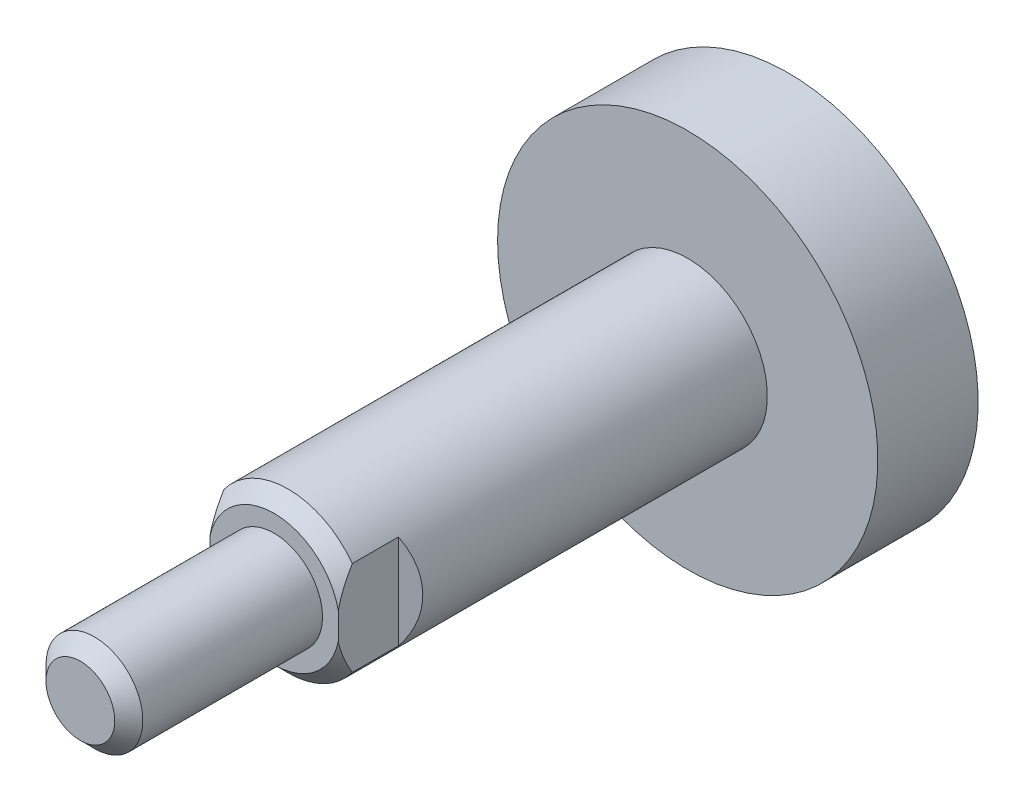
ISO-10303-21;
HEADER;
FILE_DESCRIPTION(('STEP AP214'),'2;1');
FILE_NAME('part.step','',(''),(''),'','','');
FILE_SCHEMA(('AUTOMOTIVE_DESIGN { 1 0 10303 214 1 1 1 1 }'));
ENDSEC;
DATA;
#1=APPLICATION_CONTEXT('core data for automotive mechanical design processes');
#2=APPLICATION_PROTOCOL_DEFINITION('international standard','automotive_design',2000,#1);
#3=PRODUCT_CONTEXT('',#1,'mechanical');
#4=PRODUCT('Part','Part','',(#3));
#5=PRODUCT_RELATED_PRODUCT_CATEGORY('part','',(#4));
#6=PRODUCT_DEFINITION_FORMATION('','',#4);
#7=PRODUCT_DEFINITION_CONTEXT('part definition',#1,'design');
#8=PRODUCT_DEFINITION('design','',#6,#7);
#9=PRODUCT_DEFINITION_SHAPE('','',#8);
#10=(LENGTH_UNIT() NAMED_UNIT(*) SI_UNIT(.MILLI.,.METRE.));
#11=(NAMED_UNIT(*) PLANE_ANGLE_UNIT() SI_UNIT($,.RADIAN.));
#12=(NAMED_UNIT(*) SI_UNIT($,.STERADIAN.) SOLID_ANGLE_UNIT());
#13=UNCERTAINTY_MEASURE_WITH_UNIT(LENGTH_MEASURE(1.E-05),#10,'distance_accuracy_value','');
#14=(GEOMETRIC_REPRESENTATION_CONTEXT(3) GLOBAL_UNCERTAINTY_ASSIGNED_CONTEXT((#13)) GLOBAL_UNIT_ASSIGNED_CONTEXT((#10,
#11,#12)) REPRESENTATION_CONTEXT('',''));
#15=CARTESIAN_POINT('',(0.,0.,0.));
#16=DIRECTION('',(0.,0.,1.));
#17=DIRECTION('',(1.,0.,0.));
#18=AXIS2_PLACEMENT_3D('',#15,#16,#17);
#19=CARTESIAN_POINT('',(0.,0.,35.266));
#20=DIRECTION('',(0.,0.,1.));
#21=DIRECTION('',(1.,0.,0.));
#22=AXIS2_PLACEMENT_3D('',#19,#20,#21);
#23=PLANE('',#22);
#24=CARTESIAN_POINT('',(0.,0.,35.2659999999219));
#25=DIRECTION('',(0.,0.,-1.));
#26=DIRECTION('',(-1.,0.,0.));
#27=AXIS2_PLACEMENT_3D('',#24,#25,#26);
#28=CIRCLE('',#27,1.71299999999519);
#29=CARTESIAN_POINT('',(-1.71299999999519,0.,35.2659999999219));
#30=VERTEX_POINT('',#29);
#31=EDGE_CURVE('E20',#30,#30,#28,.T.);
#32=ORIENTED_EDGE('',*,*,#31,.F.);
#33=EDGE_LOOP('',(#32));
#34=FACE_BOUND('',#33,.T.);
#35=ADVANCED_FACE('F17',(#34),#23,.T.);
#36=CARTESIAN_POINT('',(0.,0.,34.5659999999839));
#37=DIRECTION('',(0.,0.,-1.));
#38=DIRECTION('',(-1.,0.,0.));
#39=AXIS2_PLACEMENT_3D('',#36,#37,#38);
#40=CONICAL_SURFACE('',#39,2.41299999993316,0.785398163397448);
#41=ORIENTED_EDGE('',*,*,#31,.T.);
#42=EDGE_LOOP('',(#41));
#43=FACE_BOUND('',#42,.T.);
#44=CARTESIAN_POINT('',(0.,0.,34.566));
#45=DIRECTION('',(0.,0.,-1.));
#46=DIRECTION('',(-1.,0.,0.));
#47=AXIS2_PLACEMENT_3D('',#44,#45,#46);
#48=CIRCLE('',#47,2.413);
#49=CARTESIAN_POINT('',(-2.413,0.,34.566));
#50=VERTEX_POINT('',#49);
#51=EDGE_CURVE('E72',#50,#50,#48,.T.);
#52=ORIENTED_EDGE('',*,*,#51,.F.);
#53=EDGE_LOOP('',(#52));
#54=FACE_BOUND('',#53,.T.);
#55=ADVANCED_FACE('F197',(#43,#54),#40,.T.);
#56=CARTESIAN_POINT('',(0.,0.,35.266));
#57=DIRECTION('',(0.,0.,-1.));
#58=DIRECTION('',(-1.,0.,0.));
#59=AXIS2_PLACEMENT_3D('',#56,#57,#58);
#60=CYLINDRICAL_SURFACE('',#59,2.413);
#61=ORIENTED_EDGE('',*,*,#51,.T.);
#62=EDGE_LOOP('',(#61));
#63=FACE_BOUND('',#62,.T.);
#64=CARTESIAN_POINT('',(0.,0.,25.614));
#65=DIRECTION('',(0.,0.,-1.));
#66=DIRECTION('',(-1.,0.,0.));
#67=AXIS2_PLACEMENT_3D('',#64,#65,#66);
#68=CIRCLE('',#67,2.413);
#69=CARTESIAN_POINT('',(-2.413,0.,25.614));
#70=VERTEX_POINT('',#69);
#71=EDGE_CURVE('E71',#70,#70,#68,.F.);
#72=ORIENTED_EDGE('',*,*,#71,.T.);
#73=EDGE_LOOP('',(#72));
#74=FACE_BOUND('',#73,.T.);
#75=ADVANCED_FACE('F205',(#63,#74),#60,.T.);
#76=CARTESIAN_POINT('',(0.,0.,25.614));
#77=DIRECTION('',(0.,0.,-1.));
#78=DIRECTION('',(0.,1.,0.));
#79=AXIS2_PLACEMENT_3D('',#76,#77,#78);
#80=PLANE('',#79);
#81=ORIENTED_EDGE('',*,*,#71,.F.);
#82=EDGE_LOOP('',(#81));
#83=FACE_BOUND('',#82,.T.);
#84=DIRECTION('',(0.,1.,0.));
#85=VECTOR('',#84,1.);
#86=CARTESIAN_POINT('',(3.2,0.,25.614));
#87=LINE('',#86,#85);
#88=CARTESIAN_POINT('',(3.2,0.668102537170797,25.6139999999809));
#89=VERTEX_POINT('',#88);
#90=CARTESIAN_POINT('',(3.2,-0.668102537170798,25.6139999999809));
#91=VERTEX_POINT('',#90);
#92=EDGE_CURVE('E59',#89,#91,#87,.F.);
#93=ORIENTED_EDGE('',*,*,#92,.F.);
#94=CARTESIAN_POINT('',(0.,0.,25.6139999999618));
#95=DIRECTION('',(0.,0.,-1.));
#96=DIRECTION('',(0.,1.,0.));
#97=AXIS2_PLACEMENT_3D('',#94,#95,#96);
#98=CIRCLE('',#97,3.26900000004571);
#99=CARTESIAN_POINT('',(-3.2,0.668102537155263,25.6139999999841));
#100=VERTEX_POINT('',#99);
#101=EDGE_CURVE('E92',#100,#89,#98,.T.);
#102=ORIENTED_EDGE('',*,*,#101,.F.);
#103=DIRECTION('',(0.,1.,0.));
#104=VECTOR('',#103,1.);
#105=CARTESIAN_POINT('',(-3.2,-9.475,25.614));
#106=LINE('',#105,#104);
#107=CARTESIAN_POINT('',(-3.2,-0.668102537154732,25.6139999999842));
#108=VERTEX_POINT('',#107);
#109=EDGE_CURVE('E78',#100,#108,#106,.F.);
#110=ORIENTED_EDGE('',*,*,#109,.T.);
#111=CARTESIAN_POINT('',(0.,0.,25.6139999999618));
#112=DIRECTION('',(0.,0.,-1.));
#113=DIRECTION('',(0.,1.,0.));
#114=AXIS2_PLACEMENT_3D('',#111,#112,#113);
#115=CIRCLE('',#114,3.26900000004571);
#116=EDGE_CURVE('E76',#91,#108,#115,.T.);
#117=ORIENTED_EDGE('',*,*,#116,.F.);
#118=EDGE_LOOP('',(#93,#102,#110,#117));
#119=FACE_BOUND('',#118,.T.);
#120=ADVANCED_FACE('F77',(#83,#119),#80,.F.);
#121=CARTESIAN_POINT('',(0.,0.,24.9140000000807));
#122=DIRECTION('',(0.,0.,-1.));
#123=DIRECTION('',(0.,1.,0.));
#124=AXIS2_PLACEMENT_3D('',#121,#122,#123);
#125=CONICAL_SURFACE('',#124,3.96899999998368,0.785398163438051);
#126=CARTESIAN_POINT('',(-3.20000000000324,-0.668102537045559,25.6140000000079));
#127=CARTESIAN_POINT('',(-3.20000000000116,-0.791923989307162,25.5887118948215));
#128=CARTESIAN_POINT('',(-3.20000000000031,-0.914214432197644,25.5569533814339));
#129=CARTESIAN_POINT('',(-3.19999999999969,-1.15522323067472,25.482786734809));
#130=CARTESIAN_POINT('',(-3.19999999999992,-1.27394966585461,25.440405109426));
#131=CARTESIAN_POINT('',(-3.20000000000008,-1.50692397331803,25.3475394481742));
#132=CARTESIAN_POINT('',(-3.20000000000002,-1.62120166838874,25.2971285477279));
#133=CARTESIAN_POINT('',(-3.19999999999998,-1.8466563464418,25.1897204575799));
#134=CARTESIAN_POINT('',(-3.2,-1.95783200288132,25.1327205021669));
#135=CARTESIAN_POINT('',(-3.2,-2.1147772258552,25.047544782855));
#136=CARTESIAN_POINT('',(-3.2,-2.161701362435,25.021462011141));
#137=CARTESIAN_POINT('',(-3.2,-2.25515024754835,24.9683835316909));
#138=CARTESIAN_POINT('',(-3.2,-2.30167405357722,24.9413861634868));
#139=CARTESIAN_POINT('',(-3.2,-2.34796954838271,24.9140000000477));
#140=B_SPLINE_CURVE_WITH_KNOTS('',3,(#126,#127,#128,#129,#130,#131,#132,#133,#134,#135,#136,
#137,#138,#139),.UNSPECIFIED.,.F.,.F.,(4,2,2,2,2,2,4),(0.,0.378663318923574,0.756391005243895,
1.13085654278463,1.50547983437227,1.66653163363144,1.82789340191547),.UNSPECIFIED.);
#141=CARTESIAN_POINT('',(-3.2,-2.3479695483686,24.9140000000238));
#142=VERTEX_POINT('',#141);
#143=EDGE_CURVE('E117',#108,#142,#140,.T.);
#144=ORIENTED_EDGE('',*,*,#143,.T.);
#145=CARTESIAN_POINT('',(0.,0.,24.914));
#146=DIRECTION('',(0.,0.,-1.));
#147=DIRECTION('',(-1.,0.,0.));
#148=AXIS2_PLACEMENT_3D('',#145,#146,#147);
#149=CIRCLE('',#148,3.969);
#150=CARTESIAN_POINT('',(3.2,-2.3479695483686,24.9140000000238));
#151=VERTEX_POINT('',#150);
#152=EDGE_CURVE('E86',#151,#142,#149,.T.);
#153=ORIENTED_EDGE('',*,*,#152,.F.);
#154=CARTESIAN_POINT('',(3.2,-2.34796954838271,24.9140000000477));
#155=CARTESIAN_POINT('',(3.2,-2.28227540638902,24.9528576848915));
#156=CARTESIAN_POINT('',(3.2,-2.21612013329714,24.9909397042438));
#157=CARTESIAN_POINT('',(3.2,-2.08277615458881,25.065293160087));
#158=CARTESIAN_POINT('',(3.2,-2.01558715530726,25.1015640691656));
#159=CARTESIAN_POINT('',(3.2,-1.81330543751406,25.2067462963586));
#160=CARTESIAN_POINT('',(3.2,-1.6765834937986,25.2725768397312));
#161=CARTESIAN_POINT('',(3.2,-1.39788707534561,25.3932563066866));
#162=CARTESIAN_POINT('',(3.2,-1.25590184064602,25.4480810761872));
#163=CARTESIAN_POINT('',(3.2,-0.966123687795267,25.5431571719073));
#164=CARTESIAN_POINT('',(3.2,-0.81829778980787,25.5833066541209));
#165=CARTESIAN_POINT('',(3.2,-0.668102537044839,25.6140000000067));
#166=B_SPLINE_CURVE_WITH_KNOTS('',3,(#154,#155,#156,#157,#158,#159,#160,#161,#162,#163,#164,
#165),.UNSPECIFIED.,.F.,.F.,(4,2,2,2,2,4),(0.,0.228972156487963,0.458010607517393,
0.91289148643811,1.36876002116686,1.82773469580556),.UNSPECIFIED.);
#167=EDGE_CURVE('E64',#151,#91,#166,.T.);
#168=ORIENTED_EDGE('',*,*,#167,.T.);
#169=ORIENTED_EDGE('',*,*,#116,.T.);
#170=EDGE_LOOP('',(#144,#153,#168,#169));
#171=FACE_BOUND('',#170,.T.);
#172=ADVANCED_FACE('F85',(#171),#125,.T.);
#173=CARTESIAN_POINT('',(3.2,-9.475,22.614));
#174=DIRECTION('',(-0.500000000000005,0.,-0.866025403784436));
#175=DIRECTION('',(-0.866025403784436,0.,0.500000000000005));
#176=AXIS2_PLACEMENT_3D('',#173,#174,#175);
#177=PLANE('',#176);
#178=CARTESIAN_POINT('',(0.,0.,24.4615208614068));
#179=DIRECTION('',(-0.500000000000005,0.,-0.866025403784436));
#180=DIRECTION('',(0.866025403784436,0.,-0.500000000000005));
#181=AXIS2_PLACEMENT_3D('',#178,#179,#180);
#182=ELLIPSE('',#181,4.58300643682726,3.969);
#183=CARTESIAN_POINT('',(3.2,2.34796954835449,22.614));
#184=VERTEX_POINT('',#183);
#185=CARTESIAN_POINT('',(3.2,-2.34796954835449,22.614));
#186=VERTEX_POINT('',#185);
#187=EDGE_CURVE('E176',#184,#186,#182,.T.);
#188=ORIENTED_EDGE('',*,*,#187,.F.);
#189=DIRECTION('',(0.,1.,0.));
#190=VECTOR('',#189,1.);
#191=CARTESIAN_POINT('',(3.2,-9.475,22.614));
#192=LINE('',#191,#190);
#193=EDGE_CURVE('E87',#184,#186,#192,.F.);
#194=ORIENTED_EDGE('',*,*,#193,.T.);
#195=EDGE_LOOP('',(#188,#194));
#196=FACE_BOUND('',#195,.T.);
#197=ADVANCED_FACE('F112',(#196),#177,.F.);
#198=CARTESIAN_POINT('',(-3.2,-9.475,22.614));
#199=DIRECTION('',(0.500000000000004,0.,-0.866025403784436));
#200=DIRECTION('',(-0.866025403784436,0.,-0.500000000000004));
#201=AXIS2_PLACEMENT_3D('',#198,#199,#200);
#202=PLANE('',#201);
#203=CARTESIAN_POINT('',(0.,0.,24.4615208614068));
#204=DIRECTION('',(0.500000000000004,0.,-0.866025403784436));
#205=DIRECTION('',(-0.866025403784436,0.,-0.500000000000004));
#206=AXIS2_PLACEMENT_3D('',#203,#204,#205);
#207=ELLIPSE('',#206,4.58300643682726,3.969);
#208=CARTESIAN_POINT('',(-3.2,-2.34796954835449,22.614));
#209=VERTEX_POINT('',#208);
#210=CARTESIAN_POINT('',(-3.2,2.34796954835449,22.614));
#211=VERTEX_POINT('',#210);
#212=EDGE_CURVE('E173',#209,#211,#207,.T.);
#213=ORIENTED_EDGE('',*,*,#212,.F.);
#214=DIRECTION('',(0.,1.,0.));
#215=VECTOR('',#214,1.);
#216=CARTESIAN_POINT('',(-3.2,-9.475,22.614));
#217=LINE('',#216,#215);
#218=EDGE_CURVE('E82',#209,#211,#217,.T.);
#219=ORIENTED_EDGE('',*,*,#218,.T.);
#220=EDGE_LOOP('',(#213,#219));
#221=FACE_BOUND('',#220,.T.);
#222=ADVANCED_FACE('F130',(#221),#202,.F.);
#223=CARTESIAN_POINT('',(-3.2,-9.475,25.614));
#224=DIRECTION('',(1.,0.,0.));
#225=DIRECTION('',(0.,0.,-1.));
#226=AXIS2_PLACEMENT_3D('',#223,#224,#225);
#227=PLANE('',#226);
#228=ORIENTED_EDGE('',*,*,#143,.F.);
#229=ORIENTED_EDGE('',*,*,#109,.F.);
#230=CARTESIAN_POINT('',(-3.19999999998987,2.34796954838807,24.9140000000384));
#231=CARTESIAN_POINT('',(-3.19999999999627,2.28227540639574,24.9528576848853));
#232=CARTESIAN_POINT('',(-3.19999999999898,2.21612013330425,24.9909397042391));
#233=CARTESIAN_POINT('',(-3.20000000000102,2.08277615459583,25.0652931600838));
#234=CARTESIAN_POINT('',(-3.20000000000036,2.01558715531381,25.1015640691624));
#235=CARTESIAN_POINT('',(-3.19999999999929,1.81330543751945,25.2067462963555));
#236=CARTESIAN_POINT('',(-3.1999999999998,1.67658349380355,25.2725768397288));
#237=CARTESIAN_POINT('',(-3.2000000000002,1.39788707534955,25.3932563066852));
#238=CARTESIAN_POINT('',(-3.2000000000001,1.2559018406494,25.4480810761861));
#239=CARTESIAN_POINT('',(-3.1999999999999,0.966123687797418,25.5431571719066));
#240=CARTESIAN_POINT('',(-3.19999999999979,0.818297789809342,25.5833066541205));
#241=CARTESIAN_POINT('',(-3.2,0.668102537045687,25.6140000000065));
#242=B_SPLINE_CURVE_WITH_KNOTS('',3,(#230,#231,#232,#233,#234,#235,#236,#237,#238,#239,#240,
#241),.UNSPECIFIED.,.F.,.F.,(4,2,2,2,2,4),(0.,0.228972156489184,0.458010607519769,
0.912891486442607,1.3687600211732,1.82773469581398),.UNSPECIFIED.);
#243=CARTESIAN_POINT('',(-3.2,2.34796954835449,24.9140000000322));
#244=VERTEX_POINT('',#243);
#245=EDGE_CURVE('E122',#244,#100,#242,.T.);
#246=ORIENTED_EDGE('',*,*,#245,.F.);
#247=DIRECTION('',(0.,0.,-1.));
#248=VECTOR('',#247,1.);
#249=CARTESIAN_POINT('',(-3.2,2.34796954835449,36.8400272581176));
#250=LINE('',#249,#248);
#251=EDGE_CURVE('E175',#211,#244,#250,.F.);
#252=ORIENTED_EDGE('',*,*,#251,.F.);
#253=ORIENTED_EDGE('',*,*,#218,.F.);
#254=DIRECTION('',(0.,0.,-1.));
#255=VECTOR('',#254,1.);
#256=CARTESIAN_POINT('',(-3.2,-2.34796954835449,36.8400272581176));
#257=LINE('',#256,#255);
#258=EDGE_CURVE('E178',#142,#209,#257,.T.);
#259=ORIENTED_EDGE('',*,*,#258,.F.);
#260=EDGE_LOOP('',(#228,#229,#246,#252,#253,#259));
#261=FACE_BOUND('',#260,.T.);
#262=ADVANCED_FACE('F126',(#261),#227,.F.);
#263=CARTESIAN_POINT('',(0.,0.,24.9140000000807));
#264=DIRECTION('',(0.,0.,-1.));
#265=DIRECTION('',(0.,1.,0.));
#266=AXIS2_PLACEMENT_3D('',#263,#264,#265);
#267=CONICAL_SURFACE('',#266,3.96899999998368,0.785398163438051);
#268=ORIENTED_EDGE('',*,*,#245,.T.);
#269=ORIENTED_EDGE('',*,*,#101,.T.);
#270=CARTESIAN_POINT('',(3.20000000000325,0.668102537045564,25.6140000000079));
#271=CARTESIAN_POINT('',(3.20000000000117,0.791923989307168,25.5887118948215));
#272=CARTESIAN_POINT('',(3.20000000000031,0.914214432197651,25.5569533814339));
#273=CARTESIAN_POINT('',(3.19999999999969,1.15522323067473,25.482786734809));
#274=CARTESIAN_POINT('',(3.19999999999992,1.27394966585462,25.440405109426));
#275=CARTESIAN_POINT('',(3.20000000000008,1.50692397331804,25.3475394481742));
#276=CARTESIAN_POINT('',(3.20000000000003,1.62120166838875,25.2971285477279));
#277=CARTESIAN_POINT('',(3.19999999999998,1.84665634644181,25.1897204575799));
#278=CARTESIAN_POINT('',(3.2,1.95783200288133,25.1327205021669));
#279=CARTESIAN_POINT('',(3.20000000000001,2.11477722585521,25.0475447828549));
#280=CARTESIAN_POINT('',(3.2,2.161701362435,25.021462011141));
#281=CARTESIAN_POINT('',(3.2,2.25515024754835,24.9683835316909));
#282=CARTESIAN_POINT('',(3.2,2.30167405357722,24.9413861634868));
#283=CARTESIAN_POINT('',(3.2,2.34796954838271,24.9140000000477));
#284=B_SPLINE_CURVE_WITH_KNOTS('',3,(#270,#271,#272,#273,#274,#275,#276,#277,#278,#279,#280,
#281,#282,#283),.UNSPECIFIED.,.F.,.F.,(4,2,2,2,2,2,4),(0.,0.378663318923575,0.756391005243901,
1.13085654278463,1.50547983437227,1.66653163363144,1.82789340191546),.UNSPECIFIED.);
#285=CARTESIAN_POINT('',(3.2,2.3479695483686,24.9140000000238));
#286=VERTEX_POINT('',#285);
#287=EDGE_CURVE('E67',#89,#286,#284,.T.);
#288=ORIENTED_EDGE('',*,*,#287,.T.);
#289=CARTESIAN_POINT('',(0.,0.,24.914));
#290=DIRECTION('',(0.,0.,-1.));
#291=DIRECTION('',(-1.,0.,0.));
#292=AXIS2_PLACEMENT_3D('',#289,#290,#291);
#293=CIRCLE('',#292,3.969);
#294=EDGE_CURVE('E35',#244,#286,#293,.T.);
#295=ORIENTED_EDGE('',*,*,#294,.F.);
#296=EDGE_LOOP('',(#268,#269,#288,#295));
#297=FACE_BOUND('',#296,.T.);
#298=ADVANCED_FACE('F129',(#297),#267,.T.);
#299=CARTESIAN_POINT('',(3.2,-9.475,25.614));
#300=DIRECTION('',(-1.,0.,0.));
#301=DIRECTION('',(0.,0.,1.));
#302=AXIS2_PLACEMENT_3D('',#299,#300,#301);
#303=PLANE('',#302);
#304=ORIENTED_EDGE('',*,*,#287,.F.);
#305=ORIENTED_EDGE('',*,*,#92,.T.);
#306=ORIENTED_EDGE('',*,*,#167,.F.);
#307=DIRECTION('',(0.,0.,-1.));
#308=VECTOR('',#307,1.);
#309=CARTESIAN_POINT('',(3.20000000000001,-2.34796954835449,36.8400272581176));
#310=LINE('',#309,#308);
#311=EDGE_CURVE('E89',#186,#151,#310,.F.);
#312=ORIENTED_EDGE('',*,*,#311,.F.);
#313=ORIENTED_EDGE('',*,*,#193,.F.);
#314=DIRECTION('',(0.,0.,-1.));
#315=VECTOR('',#314,1.);
#316=CARTESIAN_POINT('',(3.2,2.34796954835449,36.8400272581176));
#317=LINE('',#316,#315);
#318=EDGE_CURVE('E167',#286,#184,#317,.T.);
#319=ORIENTED_EDGE('',*,*,#318,.F.);
#320=EDGE_LOOP('',(#304,#305,#306,#312,#313,#319));
#321=FACE_BOUND('',#320,.T.);
#322=ADVANCED_FACE('F61',(#321),#303,.F.);
#323=CARTESIAN_POINT('',(0.,0.,36.8400272581176));
#324=DIRECTION('',(0.,0.,-1.));
#325=DIRECTION('',(-1.,0.,0.));
#326=AXIS2_PLACEMENT_3D('',#323,#324,#325);
#327=CYLINDRICAL_SURFACE('',#326,3.969);
#328=CARTESIAN_POINT('',(0.,0.,5.));
#329=DIRECTION('',(0.,0.,-1.));
#330=DIRECTION('',(-1.,0.,0.));
#331=AXIS2_PLACEMENT_3D('',#328,#329,#330);
#332=CIRCLE('',#331,3.969);
#333=CARTESIAN_POINT('',(-3.969,0.,5.));
#334=VERTEX_POINT('',#333);
#335=EDGE_CURVE('E165',#334,#334,#332,.T.);
#336=ORIENTED_EDGE('',*,*,#335,.F.);
#337=EDGE_LOOP('',(#336));
#338=FACE_BOUND('',#337,.T.);
#339=ORIENTED_EDGE('',*,*,#294,.T.);
#340=ORIENTED_EDGE('',*,*,#318,.T.);
#341=ORIENTED_EDGE('',*,*,#187,.T.);
#342=ORIENTED_EDGE('',*,*,#311,.T.);
#343=ORIENTED_EDGE('',*,*,#152,.T.);
#344=ORIENTED_EDGE('',*,*,#258,.T.);
#345=ORIENTED_EDGE('',*,*,#212,.T.);
#346=ORIENTED_EDGE('',*,*,#251,.T.);
#347=EDGE_LOOP('',(#339,#340,#341,#342,#343,#344,#345,#346));
#348=FACE_BOUND('',#347,.T.);
#349=ADVANCED_FACE('F156',(#338,#348),#327,.T.);
#350=CARTESIAN_POINT('',(0.,0.,5.));
#351=DIRECTION('',(0.,0.,1.));
#352=DIRECTION('',(1.,0.,0.));
#353=AXIS2_PLACEMENT_3D('',#350,#351,#352);
#354=PLANE('',#353);
#355=CARTESIAN_POINT('',(0.,0.,5.));
#356=DIRECTION('',(0.,0.,-1.));
#357=DIRECTION('',(-1.,0.,0.));
#358=AXIS2_PLACEMENT_3D('',#355,#356,#357);
#359=CIRCLE('',#358,9.475);
#360=CARTESIAN_POINT('',(-9.475,0.,5.));
#361=VERTEX_POINT('',#360);
#362=EDGE_CURVE('E26',#361,#361,#359,.T.);
#363=ORIENTED_EDGE('',*,*,#362,.F.);
#364=EDGE_LOOP('',(#363));
#365=FACE_BOUND('',#364,.T.);
#366=ORIENTED_EDGE('',*,*,#335,.T.);
#367=EDGE_LOOP('',(#366));
#368=FACE_BOUND('',#367,.T.);
#369=ADVANCED_FACE('F150',(#365,#368),#354,.T.);
#370=CARTESIAN_POINT('',(0.,0.,5.));
#371=DIRECTION('',(0.,0.,-1.));
#372=DIRECTION('',(-1.,0.,0.));
#373=AXIS2_PLACEMENT_3D('',#370,#371,#372);
#374=CYLINDRICAL_SURFACE('',#373,9.475);
#375=ORIENTED_EDGE('',*,*,#362,.T.);
#376=EDGE_LOOP('',(#375));
#377=FACE_BOUND('',#376,.T.);
#378=CARTESIAN_POINT('',(0.,0.,0.));
#379=DIRECTION('',(0.,0.,-1.));
#380=DIRECTION('',(-1.,0.,0.));
#381=AXIS2_PLACEMENT_3D('',#378,#379,#380);
#382=CIRCLE('',#381,9.475);
#383=CARTESIAN_POINT('',(-9.475,0.,0.));
#384=VERTEX_POINT('',#383);
#385=EDGE_CURVE('E11',#384,#384,#382,.F.);
#386=ORIENTED_EDGE('',*,*,#385,.T.);
#387=EDGE_LOOP('',(#386));
#388=FACE_BOUND('',#387,.T.);
#389=ADVANCED_FACE('F144',(#377,#388),#374,.T.);
#390=CARTESIAN_POINT('',(0.,0.,0.));
#391=DIRECTION('',(0.,0.,1.));
#392=DIRECTION('',(1.,0.,0.));
#393=AXIS2_PLACEMENT_3D('',#390,#391,#392);
#394=PLANE('',#393);
#395=ORIENTED_EDGE('',*,*,#385,.F.);
#396=EDGE_LOOP('',(#395));
#397=FACE_BOUND('',#396,.T.);
#398=ADVANCED_FACE('F142',(#397),#394,.F.);
#399=CLOSED_SHELL('',(#35,#55,#75,#120,#172,#197,#222,#262,#298,#322,#349,#369,#389,#398));
#400=MANIFOLD_SOLID_BREP('B1',#399);
#401=ADVANCED_BREP_SHAPE_REPRESENTATION('',(#18,#400),#14);
#402=SHAPE_DEFINITION_REPRESENTATION(#9,#401);
ENDSEC;
END-ISO-10303-21;
